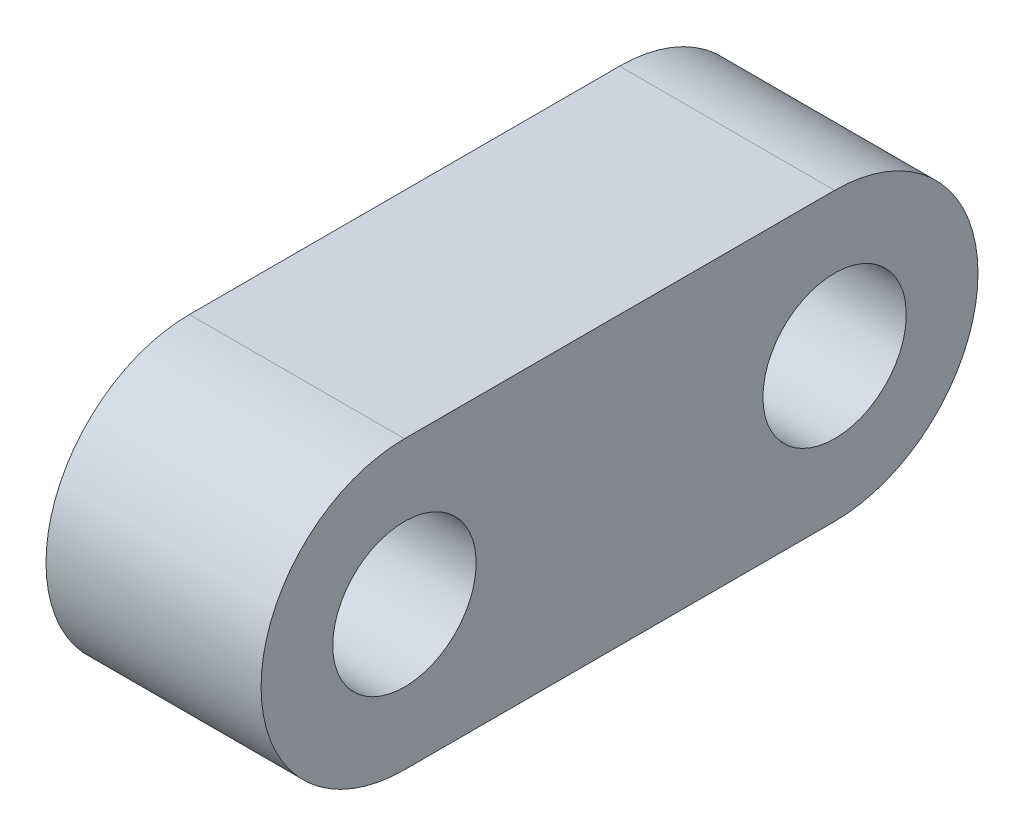
ISO-10303-21;
HEADER;
FILE_DESCRIPTION(('STEP AP214'),'2;1');
FILE_NAME('part.step','',(''),(''),'','','');
FILE_SCHEMA(('AUTOMOTIVE_DESIGN { 1 0 10303 214 1 1 1 1 }'));
ENDSEC;
DATA;
#1=APPLICATION_CONTEXT('core data for automotive mechanical design processes');
#2=APPLICATION_PROTOCOL_DEFINITION('international standard','automotive_design',2000,#1);
#3=PRODUCT_CONTEXT('',#1,'mechanical');
#4=PRODUCT('Part','Part','',(#3));
#5=PRODUCT_RELATED_PRODUCT_CATEGORY('part','',(#4));
#6=PRODUCT_DEFINITION_FORMATION('','',#4);
#7=PRODUCT_DEFINITION_CONTEXT('part definition',#1,'design');
#8=PRODUCT_DEFINITION('design','',#6,#7);
#9=PRODUCT_DEFINITION_SHAPE('','',#8);
#10=(LENGTH_UNIT() NAMED_UNIT(*) SI_UNIT(.MILLI.,.METRE.));
#11=(NAMED_UNIT(*) PLANE_ANGLE_UNIT() SI_UNIT($,.RADIAN.));
#12=(NAMED_UNIT(*) SI_UNIT($,.STERADIAN.) SOLID_ANGLE_UNIT());
#13=UNCERTAINTY_MEASURE_WITH_UNIT(LENGTH_MEASURE(1.E-05),#10,'distance_accuracy_value','');
#14=(GEOMETRIC_REPRESENTATION_CONTEXT(3) GLOBAL_UNCERTAINTY_ASSIGNED_CONTEXT((#13)) GLOBAL_UNIT_ASSIGNED_CONTEXT((#10,
#11,#12)) REPRESENTATION_CONTEXT('',''));
#15=CARTESIAN_POINT('',(0.,0.,0.));
#16=DIRECTION('',(0.,0.,1.));
#17=DIRECTION('',(1.,0.,0.));
#18=AXIS2_PLACEMENT_3D('',#15,#16,#17);
#19=CARTESIAN_POINT('',(3.,0.,0.));
#20=DIRECTION('',(1.,0.,0.));
#21=DIRECTION('',(0.,0.,-1.));
#22=AXIS2_PLACEMENT_3D('',#19,#20,#21);
#23=PLANE('',#22);
#24=CARTESIAN_POINT('',(3.,0.,-6.));
#25=DIRECTION('',(-1.,0.,0.));
#26=DIRECTION('',(0.,0.,1.));
#27=AXIS2_PLACEMENT_3D('',#24,#25,#26);
#28=CIRCLE('',#27,1.);
#29=CARTESIAN_POINT('',(3.,0.,-5.));
#30=VERTEX_POINT('',#29);
#31=EDGE_CURVE('E90',#30,#30,#28,.T.);
#32=ORIENTED_EDGE('',*,*,#31,.T.);
#33=EDGE_LOOP('',(#32));
#34=FACE_BOUND('',#33,.T.);
#35=CARTESIAN_POINT('',(3.,0.,-6.));
#36=DIRECTION('',(-1.,0.,0.));
#37=DIRECTION('',(0.,0.,1.));
#38=AXIS2_PLACEMENT_3D('',#35,#36,#37);
#39=CIRCLE('',#38,2.);
#40=CARTESIAN_POINT('',(3.,2.,-6.));
#41=VERTEX_POINT('',#40);
#42=CARTESIAN_POINT('',(3.,-2.,-6.));
#43=VERTEX_POINT('',#42);
#44=EDGE_CURVE('E19',#41,#43,#39,.T.);
#45=ORIENTED_EDGE('',*,*,#44,.F.);
#46=DIRECTION('',(0.,0.,-1.));
#47=VECTOR('',#46,1.);
#48=CARTESIAN_POINT('',(3.,2.,0.));
#49=LINE('',#48,#47);
#50=CARTESIAN_POINT('',(3.,2.,0.));
#51=VERTEX_POINT('',#50);
#52=EDGE_CURVE('E64',#41,#51,#49,.F.);
#53=ORIENTED_EDGE('',*,*,#52,.T.);
#54=CARTESIAN_POINT('',(3.,0.,0.));
#55=DIRECTION('',(-1.,0.,0.));
#56=DIRECTION('',(0.,0.,1.));
#57=AXIS2_PLACEMENT_3D('',#54,#55,#56);
#58=CIRCLE('',#57,2.);
#59=CARTESIAN_POINT('',(3.,-2.,0.));
#60=VERTEX_POINT('',#59);
#61=EDGE_CURVE('E58',#60,#51,#58,.T.);
#62=ORIENTED_EDGE('',*,*,#61,.F.);
#63=DIRECTION('',(0.,0.,1.));
#64=VECTOR('',#63,1.);
#65=CARTESIAN_POINT('',(3.,-2.,0.));
#66=LINE('',#65,#64);
#67=EDGE_CURVE('E61',#60,#43,#66,.F.);
#68=ORIENTED_EDGE('',*,*,#67,.T.);
#69=EDGE_LOOP('',(#45,#53,#62,#68));
#70=FACE_BOUND('',#69,.T.);
#71=CARTESIAN_POINT('',(3.,0.,0.));
#72=DIRECTION('',(-1.,0.,0.));
#73=DIRECTION('',(0.,0.,1.));
#74=AXIS2_PLACEMENT_3D('',#71,#72,#73);
#75=CIRCLE('',#74,1.);
#76=CARTESIAN_POINT('',(3.,0.,1.));
#77=VERTEX_POINT('',#76);
#78=EDGE_CURVE('E93',#77,#77,#75,.T.);
#79=ORIENTED_EDGE('',*,*,#78,.T.);
#80=EDGE_LOOP('',(#79));
#81=FACE_BOUND('',#80,.T.);
#82=ADVANCED_FACE('F16',(#34,#70,#81),#23,.T.);
#83=CARTESIAN_POINT('',(3.,-2.,0.));
#84=DIRECTION('',(0.,1.,0.));
#85=DIRECTION('',(0.,0.,1.));
#86=AXIS2_PLACEMENT_3D('',#83,#84,#85);
#87=PLANE('',#86);
#88=DIRECTION('',(-1.,0.,0.));
#89=VECTOR('',#88,1.);
#90=CARTESIAN_POINT('',(3.,-2.,-6.));
#91=LINE('',#90,#89);
#92=CARTESIAN_POINT('',(0.,-2.,-6.));
#93=VERTEX_POINT('',#92);
#94=EDGE_CURVE('E73',#43,#93,#91,.T.);
#95=ORIENTED_EDGE('',*,*,#94,.F.);
#96=ORIENTED_EDGE('',*,*,#67,.F.);
#97=DIRECTION('',(1.,0.,0.));
#98=VECTOR('',#97,1.);
#99=CARTESIAN_POINT('',(3.,-2.,0.));
#100=LINE('',#99,#98);
#101=CARTESIAN_POINT('',(0.,-2.,0.));
#102=VERTEX_POINT('',#101);
#103=EDGE_CURVE('E72',#102,#60,#100,.T.);
#104=ORIENTED_EDGE('',*,*,#103,.F.);
#105=DIRECTION('',(0.,0.,-1.));
#106=VECTOR('',#105,1.);
#107=CARTESIAN_POINT('',(0.,-2.,0.));
#108=LINE('',#107,#106);
#109=EDGE_CURVE('E88',#102,#93,#108,.T.);
#110=ORIENTED_EDGE('',*,*,#109,.T.);
#111=EDGE_LOOP('',(#95,#96,#104,#110));
#112=FACE_BOUND('',#111,.T.);
#113=ADVANCED_FACE('F70',(#112),#87,.F.);
#114=CARTESIAN_POINT('',(3.,0.,-6.));
#115=DIRECTION('',(-1.,0.,0.));
#116=DIRECTION('',(0.,0.,1.));
#117=AXIS2_PLACEMENT_3D('',#114,#115,#116);
#118=CYLINDRICAL_SURFACE('',#117,2.);
#119=ORIENTED_EDGE('',*,*,#44,.T.);
#120=ORIENTED_EDGE('',*,*,#94,.T.);
#121=CARTESIAN_POINT('',(0.,0.,-6.));
#122=DIRECTION('',(-1.,0.,0.));
#123=DIRECTION('',(0.,0.,1.));
#124=AXIS2_PLACEMENT_3D('',#121,#122,#123);
#125=CIRCLE('',#124,2.);
#126=CARTESIAN_POINT('',(0.,2.,-6.));
#127=VERTEX_POINT('',#126);
#128=EDGE_CURVE('E85',#93,#127,#125,.F.);
#129=ORIENTED_EDGE('',*,*,#128,.T.);
#130=DIRECTION('',(1.,0.,0.));
#131=VECTOR('',#130,1.);
#132=CARTESIAN_POINT('',(3.,2.,-6.));
#133=LINE('',#132,#131);
#134=EDGE_CURVE('E80',#127,#41,#133,.T.);
#135=ORIENTED_EDGE('',*,*,#134,.T.);
#136=EDGE_LOOP('',(#119,#120,#129,#135));
#137=FACE_BOUND('',#136,.T.);
#138=ADVANCED_FACE('F101',(#137),#118,.T.);
#139=CARTESIAN_POINT('',(3.,2.,0.));
#140=DIRECTION('',(0.,-1.,0.));
#141=DIRECTION('',(0.,0.,-1.));
#142=AXIS2_PLACEMENT_3D('',#139,#140,#141);
#143=PLANE('',#142);
#144=DIRECTION('',(-1.,0.,0.));
#145=VECTOR('',#144,1.);
#146=CARTESIAN_POINT('',(3.,2.,0.));
#147=LINE('',#146,#145);
#148=CARTESIAN_POINT('',(0.,2.,0.));
#149=VERTEX_POINT('',#148);
#150=EDGE_CURVE('E68',#51,#149,#147,.T.);
#151=ORIENTED_EDGE('',*,*,#150,.F.);
#152=ORIENTED_EDGE('',*,*,#52,.F.);
#153=ORIENTED_EDGE('',*,*,#134,.F.);
#154=DIRECTION('',(0.,0.,-1.));
#155=VECTOR('',#154,1.);
#156=CARTESIAN_POINT('',(0.,2.,0.));
#157=LINE('',#156,#155);
#158=EDGE_CURVE('E84',#127,#149,#157,.F.);
#159=ORIENTED_EDGE('',*,*,#158,.T.);
#160=EDGE_LOOP('',(#151,#152,#153,#159));
#161=FACE_BOUND('',#160,.T.);
#162=ADVANCED_FACE('F104',(#161),#143,.F.);
#163=CARTESIAN_POINT('',(3.,0.,0.));
#164=DIRECTION('',(-1.,0.,0.));
#165=DIRECTION('',(0.,0.,1.));
#166=AXIS2_PLACEMENT_3D('',#163,#164,#165);
#167=CYLINDRICAL_SURFACE('',#166,2.);
#168=ORIENTED_EDGE('',*,*,#150,.T.);
#169=CARTESIAN_POINT('',(0.,0.,0.));
#170=DIRECTION('',(-1.,0.,0.));
#171=DIRECTION('',(0.,0.,1.));
#172=AXIS2_PLACEMENT_3D('',#169,#170,#171);
#173=CIRCLE('',#172,2.);
#174=EDGE_CURVE('E34',#149,#102,#173,.F.);
#175=ORIENTED_EDGE('',*,*,#174,.T.);
#176=ORIENTED_EDGE('',*,*,#103,.T.);
#177=ORIENTED_EDGE('',*,*,#61,.T.);
#178=EDGE_LOOP('',(#168,#175,#176,#177));
#179=FACE_BOUND('',#178,.T.);
#180=ADVANCED_FACE('F75',(#179),#167,.T.);
#181=CARTESIAN_POINT('',(3.,0.,0.));
#182=DIRECTION('',(-1.,0.,0.));
#183=DIRECTION('',(0.,0.,1.));
#184=AXIS2_PLACEMENT_3D('',#181,#182,#183);
#185=CYLINDRICAL_SURFACE('',#184,1.);
#186=CARTESIAN_POINT('',(0.,0.,0.));
#187=DIRECTION('',(-1.,0.,0.));
#188=DIRECTION('',(0.,0.,1.));
#189=AXIS2_PLACEMENT_3D('',#186,#187,#188);
#190=CIRCLE('',#189,1.);
#191=CARTESIAN_POINT('',(0.,0.,1.));
#192=VERTEX_POINT('',#191);
#193=EDGE_CURVE('E25',#192,#192,#190,.T.);
#194=ORIENTED_EDGE('',*,*,#193,.T.);
#195=EDGE_LOOP('',(#194));
#196=FACE_BOUND('',#195,.T.);
#197=ORIENTED_EDGE('',*,*,#78,.F.);
#198=EDGE_LOOP('',(#197));
#199=FACE_BOUND('',#198,.T.);
#200=ADVANCED_FACE('F112',(#196,#199),#185,.F.);
#201=CARTESIAN_POINT('',(3.,0.,-6.));
#202=DIRECTION('',(-1.,0.,0.));
#203=DIRECTION('',(0.,0.,1.));
#204=AXIS2_PLACEMENT_3D('',#201,#202,#203);
#205=CYLINDRICAL_SURFACE('',#204,1.);
#206=CARTESIAN_POINT('',(0.,0.,-6.));
#207=DIRECTION('',(-1.,0.,0.));
#208=DIRECTION('',(0.,0.,1.));
#209=AXIS2_PLACEMENT_3D('',#206,#207,#208);
#210=CIRCLE('',#209,1.);
#211=CARTESIAN_POINT('',(0.,0.,-5.));
#212=VERTEX_POINT('',#211);
#213=EDGE_CURVE('E11',#212,#212,#210,.T.);
#214=ORIENTED_EDGE('',*,*,#213,.T.);
#215=EDGE_LOOP('',(#214));
#216=FACE_BOUND('',#215,.T.);
#217=ORIENTED_EDGE('',*,*,#31,.F.);
#218=EDGE_LOOP('',(#217));
#219=FACE_BOUND('',#218,.T.);
#220=ADVANCED_FACE('F116',(#216,#219),#205,.F.);
#221=CARTESIAN_POINT('',(0.,0.,0.));
#222=DIRECTION('',(1.,0.,0.));
#223=DIRECTION('',(0.,0.,-1.));
#224=AXIS2_PLACEMENT_3D('',#221,#222,#223);
#225=PLANE('',#224);
#226=ORIENTED_EDGE('',*,*,#213,.F.);
#227=EDGE_LOOP('',(#226));
#228=FACE_BOUND('',#227,.T.);
#229=ORIENTED_EDGE('',*,*,#193,.F.);
#230=EDGE_LOOP('',(#229));
#231=FACE_BOUND('',#230,.T.);
#232=ORIENTED_EDGE('',*,*,#158,.F.);
#233=ORIENTED_EDGE('',*,*,#128,.F.);
#234=ORIENTED_EDGE('',*,*,#109,.F.);
#235=ORIENTED_EDGE('',*,*,#174,.F.);
#236=EDGE_LOOP('',(#232,#233,#234,#235));
#237=FACE_BOUND('',#236,.T.);
#238=ADVANCED_FACE('F102',(#228,#231,#237),#225,.F.);
#239=CLOSED_SHELL('',(#82,#113,#138,#162,#180,#200,#220,#238));
#240=MANIFOLD_SOLID_BREP('B1',#239);
#241=ADVANCED_BREP_SHAPE_REPRESENTATION('',(#18,#240),#14);
#242=SHAPE_DEFINITION_REPRESENTATION(#9,#241);
ENDSEC;
END-ISO-10303-21;
